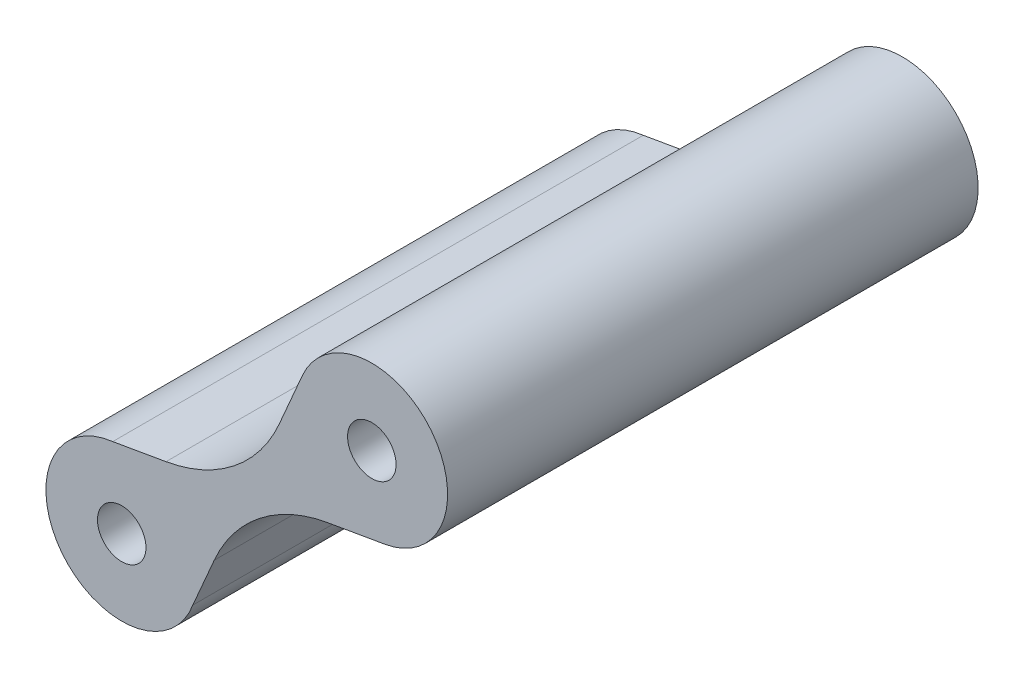
ISO-10303-21;
HEADER;
FILE_DESCRIPTION(('STEP AP214'),'2;1');
FILE_NAME('part.step','',(''),(''),'','','');
FILE_SCHEMA(('AUTOMOTIVE_DESIGN { 1 0 10303 214 1 1 1 1 }'));
ENDSEC;
DATA;
#1=APPLICATION_CONTEXT('core data for automotive mechanical design processes');
#2=APPLICATION_PROTOCOL_DEFINITION('international standard','automotive_design',2000,#1);
#3=PRODUCT_CONTEXT('',#1,'mechanical');
#4=PRODUCT('Part','Part','',(#3));
#5=PRODUCT_RELATED_PRODUCT_CATEGORY('part','',(#4));
#6=PRODUCT_DEFINITION_FORMATION('','',#4);
#7=PRODUCT_DEFINITION_CONTEXT('part definition',#1,'design');
#8=PRODUCT_DEFINITION('design','',#6,#7);
#9=PRODUCT_DEFINITION_SHAPE('','',#8);
#10=(LENGTH_UNIT() NAMED_UNIT(*) SI_UNIT(.MILLI.,.METRE.));
#11=(NAMED_UNIT(*) PLANE_ANGLE_UNIT() SI_UNIT($,.RADIAN.));
#12=(NAMED_UNIT(*) SI_UNIT($,.STERADIAN.) SOLID_ANGLE_UNIT());
#13=UNCERTAINTY_MEASURE_WITH_UNIT(LENGTH_MEASURE(1.E-05),#10,'distance_accuracy_value','');
#14=(GEOMETRIC_REPRESENTATION_CONTEXT(3) GLOBAL_UNCERTAINTY_ASSIGNED_CONTEXT((#13)) GLOBAL_UNIT_ASSIGNED_CONTEXT((#10,
#11,#12)) REPRESENTATION_CONTEXT('',''));
#15=CARTESIAN_POINT('',(0.,0.,0.));
#16=DIRECTION('',(0.,0.,1.));
#17=DIRECTION('',(1.,0.,0.));
#18=AXIS2_PLACEMENT_3D('',#15,#16,#17);
#19=CARTESIAN_POINT('',(-9.31929127703042,4.02295739112916,35.));
#20=DIRECTION('',(-0.918108315030876,0.396329562196873,0.));
#21=DIRECTION('',(-0.396329562196873,-0.918108315030876,0.));
#22=AXIS2_PLACEMENT_3D('',#19,#20,#21);
#23=PLANE('',#22);
#24=DIRECTION('',(0.396329562196873,0.918108315030877,0.));
#25=VECTOR('',#24,1.);
#26=CARTESIAN_POINT('',(-9.31929127703042,4.02295739112916,0.));
#27=LINE('',#26,#25);
#28=CARTESIAN_POINT('',(-6.10695243494029,11.4644285376963,0.));
#29=VERTEX_POINT('',#28);
#30=CARTESIAN_POINT('',(-4.5829567095026,14.99480648841,0.));
#31=VERTEX_POINT('',#30);
#32=EDGE_CURVE('E159',#29,#31,#27,.T.);
#33=ORIENTED_EDGE('',*,*,#32,.F.);
#34=DIRECTION('',(0.,0.,-1.));
#35=VECTOR('',#34,1.);
#36=CARTESIAN_POINT('',(-6.10695243494029,11.4644285376963,35.));
#37=LINE('',#36,#35);
#38=CARTESIAN_POINT('',(-6.10695243494029,11.4644285376963,35.));
#39=VERTEX_POINT('',#38);
#40=EDGE_CURVE('E11',#39,#29,#37,.T.);
#41=ORIENTED_EDGE('',*,*,#40,.F.);
#42=DIRECTION('',(0.396329562196873,0.918108315030877,0.));
#43=VECTOR('',#42,1.);
#44=CARTESIAN_POINT('',(-9.31929127703042,4.02295739112916,35.));
#45=LINE('',#44,#43);
#46=CARTESIAN_POINT('',(-4.5829567095026,14.99480648841,35.));
#47=VERTEX_POINT('',#46);
#48=EDGE_CURVE('E192',#39,#47,#45,.T.);
#49=ORIENTED_EDGE('',*,*,#48,.T.);
#50=DIRECTION('',(0.,0.,-1.));
#51=VECTOR('',#50,1.);
#52=CARTESIAN_POINT('',(-4.5829567095026,14.99480648841,35.));
#53=LINE('',#52,#51);
#54=EDGE_CURVE('E100',#47,#31,#53,.T.);
#55=ORIENTED_EDGE('',*,*,#54,.T.);
#56=EDGE_LOOP('',(#33,#41,#49,#55));
#57=FACE_BOUND('',#56,.T.);
#58=ADVANCED_FACE('F45',(#57),#23,.T.);
#59=CARTESIAN_POINT('',(-15.2880355852491,15.427724159665,35.));
#60=DIRECTION('',(0.,0.,-1.));
#61=DIRECTION('',(-1.,0.,0.));
#62=AXIS2_PLACEMENT_3D('',#59,#60,#61);
#63=CYLINDRICAL_SURFACE('',#62,10.);
#64=CARTESIAN_POINT('',(-15.2880355852491,15.427724159665,0.));
#65=DIRECTION('',(0.,0.,1.));
#66=DIRECTION('',(1.,0.,0.));
#67=AXIS2_PLACEMENT_3D('',#64,#65,#66);
#68=CIRCLE('',#67,10.);
#69=CARTESIAN_POINT('',(-13.5775473723706,5.5750986175263,0.));
#70=VERTEX_POINT('',#69);
#71=EDGE_CURVE('E163',#29,#70,#68,.F.);
#72=ORIENTED_EDGE('',*,*,#71,.T.);
#73=DIRECTION('',(0.,0.,-1.));
#74=VECTOR('',#73,1.);
#75=CARTESIAN_POINT('',(-13.5775473723706,5.5750986175263,35.));
#76=LINE('',#75,#74);
#77=CARTESIAN_POINT('',(-13.5775473723706,5.5750986175263,35.));
#78=VERTEX_POINT('',#77);
#79=EDGE_CURVE('E54',#78,#70,#76,.T.);
#80=ORIENTED_EDGE('',*,*,#79,.F.);
#81=CARTESIAN_POINT('',(-15.2880355852491,15.427724159665,35.));
#82=DIRECTION('',(0.,0.,1.));
#83=DIRECTION('',(1.,0.,0.));
#84=AXIS2_PLACEMENT_3D('',#81,#82,#83);
#85=CIRCLE('',#84,10.);
#86=EDGE_CURVE('E227',#39,#78,#85,.F.);
#87=ORIENTED_EDGE('',*,*,#86,.F.);
#88=ORIENTED_EDGE('',*,*,#40,.T.);
#89=EDGE_LOOP('',(#72,#80,#87,#88));
#90=FACE_BOUND('',#89,.T.);
#91=ADVANCED_FACE('F233',(#90),#63,.F.);
#92=CARTESIAN_POINT('',(-1.33680800953449,7.70018094279081,35.));
#93=DIRECTION('',(0.171048821287847,-0.98526255421387,0.));
#94=DIRECTION('',(0.98526255421387,0.171048821287847,0.));
#95=AXIS2_PLACEMENT_3D('',#92,#93,#94);
#96=PLANE('',#95);
#97=DIRECTION('',(-0.98526255421387,-0.171048821287847,0.));
#98=VECTOR('',#97,1.);
#99=CARTESIAN_POINT('',(-1.33680800953449,7.70018094279081,0.));
#100=LINE('',#99,#98);
#101=CARTESIAN_POINT('',(-17.0944743760461,4.96453423957318,0.));
#102=VERTEX_POINT('',#101);
#103=EDGE_CURVE('E166',#70,#102,#100,.T.);
#104=ORIENTED_EDGE('',*,*,#103,.T.);
#105=DIRECTION('',(0.,0.,-1.));
#106=VECTOR('',#105,1.);
#107=CARTESIAN_POINT('',(-17.0944743760461,4.96453423957318,35.));
#108=LINE('',#107,#106);
#109=CARTESIAN_POINT('',(-17.0944743760461,4.96453423957318,35.));
#110=VERTEX_POINT('',#109);
#111=EDGE_CURVE('E202',#110,#102,#108,.T.);
#112=ORIENTED_EDGE('',*,*,#111,.F.);
#113=DIRECTION('',(-0.98526255421387,-0.171048821287847,0.));
#114=VECTOR('',#113,1.);
#115=CARTESIAN_POINT('',(-1.33680800953449,7.70018094279081,35.));
#116=LINE('',#115,#114);
#117=EDGE_CURVE('E213',#78,#110,#116,.T.);
#118=ORIENTED_EDGE('',*,*,#117,.F.);
#119=ORIENTED_EDGE('',*,*,#79,.T.);
#120=EDGE_LOOP('',(#104,#112,#118,#119));
#121=FACE_BOUND('',#120,.T.);
#122=ADVANCED_FACE('F211',(#121),#96,.F.);
#123=CARTESIAN_POINT('',(-16.4999999999582,-5.30305489667009E-11,35.));
#124=DIRECTION('',(0.,0.,-1.));
#125=DIRECTION('',(-1.,0.,0.));
#126=AXIS2_PLACEMENT_3D('',#123,#124,#125);
#127=CYLINDRICAL_SURFACE('',#126,5.0000000000246);
#128=CARTESIAN_POINT('',(-16.4999999999582,-5.30305489667009E-11,0.));
#129=DIRECTION('',(0.,0.,1.));
#130=DIRECTION('',(1.,0.,0.));
#131=AXIS2_PLACEMENT_3D('',#128,#129,#130);
#132=CIRCLE('',#131,5.0000000000246);
#133=CARTESIAN_POINT('',(-11.8123949926752,-1.7396434393649,0.));
#134=VERTEX_POINT('',#133);
#135=EDGE_CURVE('E169',#102,#134,#132,.T.);
#136=ORIENTED_EDGE('',*,*,#135,.T.);
#137=DIRECTION('',(0.,0.,-1.));
#138=VECTOR('',#137,1.);
#139=CARTESIAN_POINT('',(-11.8123949926752,-1.7396434393649,35.));
#140=LINE('',#139,#138);
#141=CARTESIAN_POINT('',(-11.8123949926752,-1.7396434393649,35.));
#142=VERTEX_POINT('',#141);
#143=EDGE_CURVE('E199',#142,#134,#140,.T.);
#144=ORIENTED_EDGE('',*,*,#143,.F.);
#145=CARTESIAN_POINT('',(-16.4999999999582,-5.30305489667009E-11,35.));
#146=DIRECTION('',(0.,0.,1.));
#147=DIRECTION('',(1.,0.,0.));
#148=AXIS2_PLACEMENT_3D('',#145,#146,#147);
#149=CIRCLE('',#148,5.0000000000246);
#150=EDGE_CURVE('E145',#110,#142,#149,.T.);
#151=ORIENTED_EDGE('',*,*,#150,.F.);
#152=ORIENTED_EDGE('',*,*,#111,.T.);
#153=EDGE_LOOP('',(#136,#144,#151,#152));
#154=FACE_BOUND('',#153,.T.);
#155=ADVANCED_FACE('F223',(#154),#127,.T.);
#156=CARTESIAN_POINT('',(-9.31841828213412,4.0288013520341,35.));
#157=DIRECTION('',(0.91788520103945,-0.396846012595274,0.));
#158=DIRECTION('',(0.396846012595274,0.91788520103945,0.));
#159=AXIS2_PLACEMENT_3D('',#156,#157,#158);
#160=PLANE('',#159);
#161=DIRECTION('',(-0.396846012595274,-0.91788520103945,0.));
#162=VECTOR('',#161,1.);
#163=CARTESIAN_POINT('',(-9.31841828213412,4.0288013520341,0.));
#164=LINE('',#163,#162);
#165=CARTESIAN_POINT('',(-10.3958401342488,1.53677789219119,0.));
#166=VERTEX_POINT('',#165);
#167=EDGE_CURVE('E173',#166,#134,#164,.T.);
#168=ORIENTED_EDGE('',*,*,#167,.F.);
#169=DIRECTION('',(0.,0.,-1.));
#170=VECTOR('',#169,1.);
#171=CARTESIAN_POINT('',(-10.3958401342488,1.53677789219119,35.));
#172=LINE('',#171,#170);
#173=CARTESIAN_POINT('',(-10.3958401342488,1.53677789219119,35.));
#174=VERTEX_POINT('',#173);
#175=EDGE_CURVE('E130',#174,#166,#172,.T.);
#176=ORIENTED_EDGE('',*,*,#175,.F.);
#177=DIRECTION('',(-0.396846012595274,-0.91788520103945,0.));
#178=VECTOR('',#177,1.);
#179=CARTESIAN_POINT('',(-9.31841828213412,4.0288013520341,35.));
#180=LINE('',#179,#178);
#181=EDGE_CURVE('E141',#174,#142,#180,.T.);
#182=ORIENTED_EDGE('',*,*,#181,.T.);
#183=ORIENTED_EDGE('',*,*,#143,.T.);
#184=EDGE_LOOP('',(#168,#176,#182,#183));
#185=FACE_BOUND('',#184,.T.);
#186=ADVANCED_FACE('F243',(#185),#160,.T.);
#187=CARTESIAN_POINT('',(-1.21698812385425,-2.43168223376155,35.));
#188=DIRECTION('',(0.,0.,-1.));
#189=DIRECTION('',(-1.,0.,0.));
#190=AXIS2_PLACEMENT_3D('',#187,#188,#189);
#191=CYLINDRICAL_SURFACE('',#190,10.);
#192=CARTESIAN_POINT('',(-1.21698812385425,-2.43168223376155,0.));
#193=DIRECTION('',(0.,0.,1.));
#194=DIRECTION('',(1.,0.,0.));
#195=AXIS2_PLACEMENT_3D('',#192,#193,#194);
#196=CIRCLE('',#195,10.);
#197=CARTESIAN_POINT('',(-2.92193313581422,7.42190404262497,0.));
#198=VERTEX_POINT('',#197);
#199=EDGE_CURVE('E128',#198,#166,#196,.T.);
#200=ORIENTED_EDGE('',*,*,#199,.F.);
#201=DIRECTION('',(0.,0.,-1.));
#202=VECTOR('',#201,1.);
#203=CARTESIAN_POINT('',(-2.92193313581422,7.42190404262497,35.));
#204=LINE('',#203,#202);
#205=CARTESIAN_POINT('',(-2.92193313581422,7.42190404262497,35.));
#206=VERTEX_POINT('',#205);
#207=EDGE_CURVE('E122',#206,#198,#204,.T.);
#208=ORIENTED_EDGE('',*,*,#207,.F.);
#209=CARTESIAN_POINT('',(-1.21698812385425,-2.43168223376155,35.));
#210=DIRECTION('',(0.,0.,1.));
#211=DIRECTION('',(1.,0.,0.));
#212=AXIS2_PLACEMENT_3D('',#209,#210,#211);
#213=CIRCLE('',#212,10.);
#214=EDGE_CURVE('E126',#206,#174,#213,.T.);
#215=ORIENTED_EDGE('',*,*,#214,.T.);
#216=ORIENTED_EDGE('',*,*,#175,.T.);
#217=EDGE_LOOP('',(#200,#208,#215,#216));
#218=FACE_BOUND('',#217,.T.);
#219=ADVANCED_FACE('F124',(#218),#191,.F.);
#220=CARTESIAN_POINT('',(-1.33180257339302,7.69704094148809,35.));
#221=DIRECTION('',(-0.170494501195997,0.985358627638652,0.));
#222=DIRECTION('',(-0.985358627638652,-0.170494501195997,0.));
#223=AXIS2_PLACEMENT_3D('',#220,#221,#222);
#224=PLANE('',#223);
#225=DIRECTION('',(0.985358627638652,0.170494501195997,0.));
#226=VECTOR('',#225,1.);
#227=CARTESIAN_POINT('',(-1.33180257339302,7.69704094148809,0.));
#228=LINE('',#227,#226);
#229=CARTESIAN_POINT('',(0.86704068743674,8.07750209994138,0.));
#230=VERTEX_POINT('',#229);
#231=EDGE_CURVE('E93',#198,#230,#228,.T.);
#232=ORIENTED_EDGE('',*,*,#231,.T.);
#233=DIRECTION('',(0.,0.,-1.));
#234=VECTOR('',#233,1.);
#235=CARTESIAN_POINT('',(0.86704068743674,8.07750209994138,35.));
#236=LINE('',#235,#234);
#237=CARTESIAN_POINT('',(0.86704068743674,8.07750209994138,35.));
#238=VERTEX_POINT('',#237);
#239=EDGE_CURVE('E131',#238,#230,#236,.T.);
#240=ORIENTED_EDGE('',*,*,#239,.F.);
#241=DIRECTION('',(0.985358627638652,0.170494501195997,0.));
#242=VECTOR('',#241,1.);
#243=CARTESIAN_POINT('',(-1.33180257339302,7.69704094148809,35.));
#244=LINE('',#243,#242);
#245=EDGE_CURVE('E133',#206,#238,#244,.T.);
#246=ORIENTED_EDGE('',*,*,#245,.F.);
#247=ORIENTED_EDGE('',*,*,#207,.T.);
#248=EDGE_LOOP('',(#232,#240,#246,#247));
#249=FACE_BOUND('',#248,.T.);
#250=ADVANCED_FACE('F134',(#249),#224,.F.);
#251=CARTESIAN_POINT('',(7.08634539936526E-11,12.9999999998842,35.));
#252=DIRECTION('',(0.,0.,-1.));
#253=DIRECTION('',(-1.,0.,0.));
#254=AXIS2_PLACEMENT_3D('',#251,#252,#253);
#255=CYLINDRICAL_SURFACE('',#254,1.6000000000339);
#256=CARTESIAN_POINT('',(7.08634539936526E-11,12.9999999998842,35.));
#257=DIRECTION('',(0.,0.,1.));
#258=DIRECTION('',(1.,0.,0.));
#259=AXIS2_PLACEMENT_3D('',#256,#257,#258);
#260=CIRCLE('',#259,1.6000000000339);
#261=CARTESIAN_POINT('',(1.60000000010476,12.9999999998842,35.));
#262=VERTEX_POINT('',#261);
#263=EDGE_CURVE('E151',#262,#262,#260,.T.);
#264=ORIENTED_EDGE('',*,*,#263,.T.);
#265=EDGE_LOOP('',(#264));
#266=FACE_BOUND('',#265,.T.);
#267=CARTESIAN_POINT('',(7.08634539936526E-11,12.9999999998842,0.));
#268=DIRECTION('',(0.,0.,1.));
#269=DIRECTION('',(1.,0.,0.));
#270=AXIS2_PLACEMENT_3D('',#267,#268,#269);
#271=CIRCLE('',#270,1.6000000000339);
#272=CARTESIAN_POINT('',(1.60000000010476,12.9999999998842,0.));
#273=VERTEX_POINT('',#272);
#274=EDGE_CURVE('E184',#273,#273,#271,.T.);
#275=ORIENTED_EDGE('',*,*,#274,.F.);
#276=EDGE_LOOP('',(#275));
#277=FACE_BOUND('',#276,.T.);
#278=ADVANCED_FACE('F251',(#266,#277),#255,.F.);
#279=CARTESIAN_POINT('',(7.08634539936526E-11,12.9999999998842,35.));
#280=DIRECTION('',(0.,0.,-1.));
#281=DIRECTION('',(-1.,0.,0.));
#282=AXIS2_PLACEMENT_3D('',#279,#280,#281);
#283=CYLINDRICAL_SURFACE('',#282,4.99827421501553);
#284=CARTESIAN_POINT('',(7.08634539936526E-11,12.9999999998842,0.));
#285=DIRECTION('',(0.,0.,1.));
#286=DIRECTION('',(1.,0.,0.));
#287=AXIS2_PLACEMENT_3D('',#284,#285,#286);
#288=CIRCLE('',#287,4.99827421501553);
#289=EDGE_CURVE('E181',#230,#31,#288,.T.);
#290=ORIENTED_EDGE('',*,*,#289,.T.);
#291=ORIENTED_EDGE('',*,*,#54,.F.);
#292=CARTESIAN_POINT('',(7.08634539936526E-11,12.9999999998842,35.));
#293=DIRECTION('',(0.,0.,1.));
#294=DIRECTION('',(1.,0.,0.));
#295=AXIS2_PLACEMENT_3D('',#292,#293,#294);
#296=CIRCLE('',#295,4.99827421501553);
#297=EDGE_CURVE('E64',#238,#47,#296,.T.);
#298=ORIENTED_EDGE('',*,*,#297,.F.);
#299=ORIENTED_EDGE('',*,*,#239,.T.);
#300=EDGE_LOOP('',(#290,#291,#298,#299));
#301=FACE_BOUND('',#300,.T.);
#302=ADVANCED_FACE('F252',(#301),#283,.T.);
#303=CARTESIAN_POINT('',(-16.4999999999582,-5.30305489667009E-11,35.));
#304=DIRECTION('',(0.,0.,-1.));
#305=DIRECTION('',(-1.,0.,0.));
#306=AXIS2_PLACEMENT_3D('',#303,#304,#305);
#307=CYLINDRICAL_SURFACE('',#306,1.60000000002457);
#308=CARTESIAN_POINT('',(-16.4999999999582,-5.30305489667009E-11,35.));
#309=DIRECTION('',(0.,0.,1.));
#310=DIRECTION('',(1.,0.,0.));
#311=AXIS2_PLACEMENT_3D('',#308,#309,#310);
#312=CIRCLE('',#311,1.60000000002457);
#313=CARTESIAN_POINT('',(-14.8999999999336,-5.30305489667009E-11,35.));
#314=VERTEX_POINT('',#313);
#315=EDGE_CURVE('E155',#314,#314,#312,.T.);
#316=ORIENTED_EDGE('',*,*,#315,.T.);
#317=EDGE_LOOP('',(#316));
#318=FACE_BOUND('',#317,.T.);
#319=CARTESIAN_POINT('',(-16.4999999999582,-5.30305489667009E-11,0.));
#320=DIRECTION('',(0.,0.,1.));
#321=DIRECTION('',(1.,0.,0.));
#322=AXIS2_PLACEMENT_3D('',#319,#320,#321);
#323=CIRCLE('',#322,1.60000000002457);
#324=CARTESIAN_POINT('',(-14.8999999999336,-5.30305489667009E-11,0.));
#325=VERTEX_POINT('',#324);
#326=EDGE_CURVE('E188',#325,#325,#323,.T.);
#327=ORIENTED_EDGE('',*,*,#326,.F.);
#328=EDGE_LOOP('',(#327));
#329=FACE_BOUND('',#328,.T.);
#330=ADVANCED_FACE('F255',(#318,#329),#307,.F.);
#331=CARTESIAN_POINT('',(0.,0.,35.));
#332=DIRECTION('',(0.,0.,1.));
#333=DIRECTION('',(1.,0.,0.));
#334=AXIS2_PLACEMENT_3D('',#331,#332,#333);
#335=PLANE('',#334);
#336=ORIENTED_EDGE('',*,*,#48,.F.);
#337=ORIENTED_EDGE('',*,*,#86,.T.);
#338=ORIENTED_EDGE('',*,*,#117,.T.);
#339=ORIENTED_EDGE('',*,*,#150,.T.);
#340=ORIENTED_EDGE('',*,*,#181,.F.);
#341=ORIENTED_EDGE('',*,*,#214,.F.);
#342=ORIENTED_EDGE('',*,*,#245,.T.);
#343=ORIENTED_EDGE('',*,*,#297,.T.);
#344=EDGE_LOOP('',(#336,#337,#338,#339,#340,#341,#342,#343));
#345=FACE_BOUND('',#344,.T.);
#346=ORIENTED_EDGE('',*,*,#263,.F.);
#347=EDGE_LOOP('',(#346));
#348=FACE_BOUND('',#347,.T.);
#349=ORIENTED_EDGE('',*,*,#315,.F.);
#350=EDGE_LOOP('',(#349));
#351=FACE_BOUND('',#350,.T.);
#352=ADVANCED_FACE('F138',(#345,#348,#351),#335,.T.);
#353=CARTESIAN_POINT('',(0.,0.,0.));
#354=DIRECTION('',(0.,0.,1.));
#355=DIRECTION('',(1.,0.,0.));
#356=AXIS2_PLACEMENT_3D('',#353,#354,#355);
#357=PLANE('',#356);
#358=ORIENTED_EDGE('',*,*,#32,.T.);
#359=ORIENTED_EDGE('',*,*,#289,.F.);
#360=ORIENTED_EDGE('',*,*,#231,.F.);
#361=ORIENTED_EDGE('',*,*,#199,.T.);
#362=ORIENTED_EDGE('',*,*,#167,.T.);
#363=ORIENTED_EDGE('',*,*,#135,.F.);
#364=ORIENTED_EDGE('',*,*,#103,.F.);
#365=ORIENTED_EDGE('',*,*,#71,.F.);
#366=EDGE_LOOP('',(#358,#359,#360,#361,#362,#363,#364,#365));
#367=FACE_BOUND('',#366,.T.);
#368=ORIENTED_EDGE('',*,*,#274,.T.);
#369=EDGE_LOOP('',(#368));
#370=FACE_BOUND('',#369,.T.);
#371=ORIENTED_EDGE('',*,*,#326,.T.);
#372=EDGE_LOOP('',(#371));
#373=FACE_BOUND('',#372,.T.);
#374=ADVANCED_FACE('F218',(#367,#370,#373),#357,.F.);
#375=CLOSED_SHELL('',(#58,#91,#122,#155,#186,#219,#250,#278,#302,#330,#352,#374));
#376=MANIFOLD_SOLID_BREP('B2',#375);
#377=ADVANCED_BREP_SHAPE_REPRESENTATION('',(#18,#376),#14);
#378=SHAPE_DEFINITION_REPRESENTATION(#9,#377);
ENDSEC;
END-ISO-10303-21;
